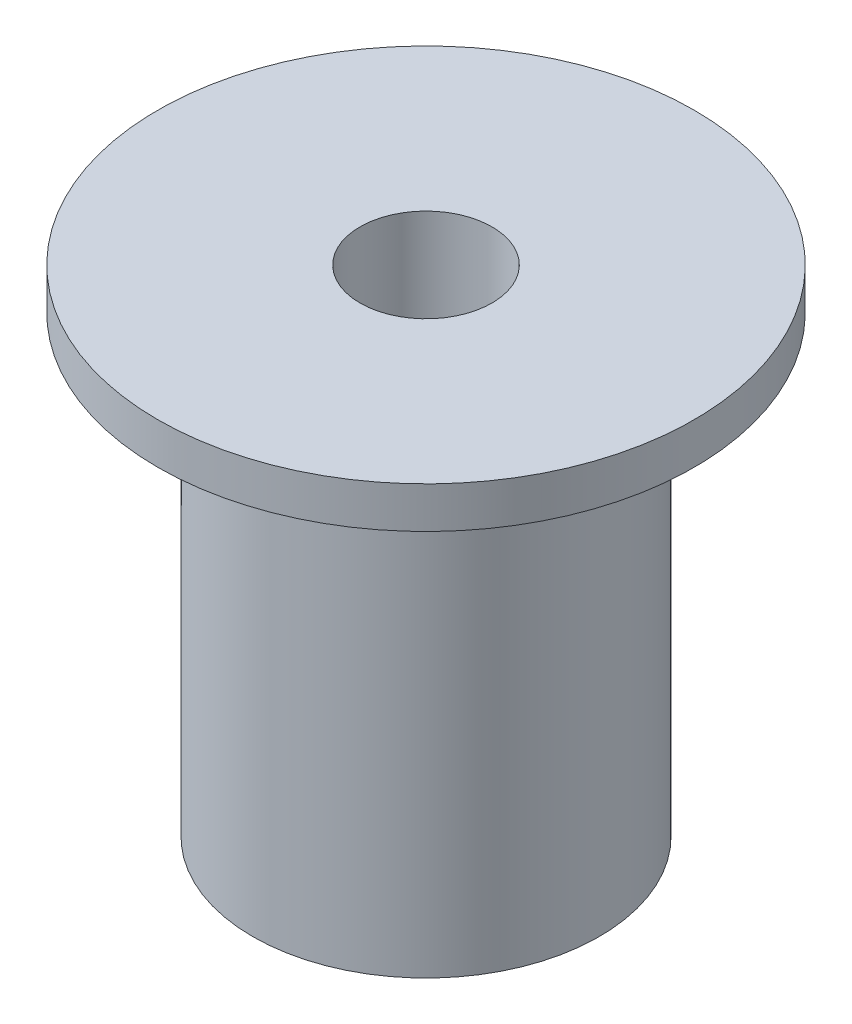
ISO-10303-21;
HEADER;
FILE_DESCRIPTION(('STEP AP214'),'2;1');
FILE_NAME('part.step','',(''),(''),'','','');
FILE_SCHEMA(('AUTOMOTIVE_DESIGN { 1 0 10303 214 1 1 1 1 }'));
ENDSEC;
DATA;
#1=APPLICATION_CONTEXT('core data for automotive mechanical design processes');
#2=APPLICATION_PROTOCOL_DEFINITION('international standard','automotive_design',2000,#1);
#3=PRODUCT_CONTEXT('',#1,'mechanical');
#4=PRODUCT('Part','Part','',(#3));
#5=PRODUCT_RELATED_PRODUCT_CATEGORY('part','',(#4));
#6=PRODUCT_DEFINITION_FORMATION('','',#4);
#7=PRODUCT_DEFINITION_CONTEXT('part definition',#1,'design');
#8=PRODUCT_DEFINITION('design','',#6,#7);
#9=PRODUCT_DEFINITION_SHAPE('','',#8);
#10=(LENGTH_UNIT() NAMED_UNIT(*) SI_UNIT(.MILLI.,.METRE.));
#11=(NAMED_UNIT(*) PLANE_ANGLE_UNIT() SI_UNIT($,.RADIAN.));
#12=(NAMED_UNIT(*) SI_UNIT($,.STERADIAN.) SOLID_ANGLE_UNIT());
#13=UNCERTAINTY_MEASURE_WITH_UNIT(LENGTH_MEASURE(1.E-05),#10,'distance_accuracy_value','');
#14=(GEOMETRIC_REPRESENTATION_CONTEXT(3) GLOBAL_UNCERTAINTY_ASSIGNED_CONTEXT((#13)) GLOBAL_UNIT_ASSIGNED_CONTEXT((#10,
#11,#12)) REPRESENTATION_CONTEXT('',''));
#15=CARTESIAN_POINT('',(0.,0.,0.));
#16=DIRECTION('',(0.,0.,1.));
#17=DIRECTION('',(1.,0.,0.));
#18=AXIS2_PLACEMENT_3D('',#15,#16,#17);
#19=CARTESIAN_POINT('',(0.,0.,0.));
#20=DIRECTION('',(0.,1.,0.));
#21=DIRECTION('',(0.,0.,1.));
#22=AXIS2_PLACEMENT_3D('',#19,#20,#21);
#23=PLANE('',#22);
#24=CARTESIAN_POINT('',(0.,0.,0.));
#25=DIRECTION('',(0.,1.,0.));
#26=DIRECTION('',(0.,0.,1.));
#27=AXIS2_PLACEMENT_3D('',#24,#25,#26);
#28=CIRCLE('',#27,4.2);
#29=CARTESIAN_POINT('',(0.,0.,4.2));
#30=VERTEX_POINT('',#29);
#31=EDGE_CURVE('E47',#30,#30,#28,.T.);
#32=ORIENTED_EDGE('',*,*,#31,.F.);
#33=EDGE_LOOP('',(#32));
#34=FACE_BOUND('',#33,.T.);
#35=CARTESIAN_POINT('',(0.,0.,0.));
#36=DIRECTION('',(0.,1.,0.));
#37=DIRECTION('',(0.,0.,1.));
#38=AXIS2_PLACEMENT_3D('',#35,#36,#37);
#39=CIRCLE('',#38,1.6);
#40=CARTESIAN_POINT('',(0.,0.,1.6));
#41=VERTEX_POINT('',#40);
#42=EDGE_CURVE('E56',#41,#41,#39,.T.);
#43=ORIENTED_EDGE('',*,*,#42,.T.);
#44=EDGE_LOOP('',(#43));
#45=FACE_BOUND('',#44,.T.);
#46=ADVANCED_FACE('F43',(#34,#45),#23,.F.);
#47=CARTESIAN_POINT('',(0.,11.,0.));
#48=DIRECTION('',(0.,-1.,0.));
#49=DIRECTION('',(0.,0.,-1.));
#50=AXIS2_PLACEMENT_3D('',#47,#48,#49);
#51=CYLINDRICAL_SURFACE('',#50,4.2);
#52=CARTESIAN_POINT('',(0.,11.,0.));
#53=DIRECTION('',(0.,1.,0.));
#54=DIRECTION('',(0.,0.,1.));
#55=AXIS2_PLACEMENT_3D('',#52,#53,#54);
#56=CIRCLE('',#55,4.2);
#57=CARTESIAN_POINT('',(0.,11.,4.2));
#58=VERTEX_POINT('',#57);
#59=EDGE_CURVE('E10',#58,#58,#56,.T.);
#60=ORIENTED_EDGE('',*,*,#59,.F.);
#61=EDGE_LOOP('',(#60));
#62=FACE_BOUND('',#61,.T.);
#63=ORIENTED_EDGE('',*,*,#31,.T.);
#64=EDGE_LOOP('',(#63));
#65=FACE_BOUND('',#64,.T.);
#66=ADVANCED_FACE('F45',(#62,#65),#51,.T.);
#67=CARTESIAN_POINT('',(0.,11.,0.));
#68=DIRECTION('',(0.,-1.,0.));
#69=DIRECTION('',(0.,0.,-1.));
#70=AXIS2_PLACEMENT_3D('',#67,#68,#69);
#71=CYLINDRICAL_SURFACE('',#70,1.6);
#72=ORIENTED_EDGE('',*,*,#42,.F.);
#73=EDGE_LOOP('',(#72));
#74=FACE_BOUND('',#73,.T.);
#75=CARTESIAN_POINT('',(0.,12.,0.));
#76=DIRECTION('',(0.,1.,0.));
#77=DIRECTION('',(0.,0.,1.));
#78=AXIS2_PLACEMENT_3D('',#75,#76,#77);
#79=CIRCLE('',#78,1.6);
#80=CARTESIAN_POINT('',(0.,12.,1.6));
#81=VERTEX_POINT('',#80);
#82=EDGE_CURVE('E66',#81,#81,#79,.T.);
#83=ORIENTED_EDGE('',*,*,#82,.T.);
#84=EDGE_LOOP('',(#83));
#85=FACE_BOUND('',#84,.T.);
#86=ADVANCED_FACE('F74',(#74,#85),#71,.F.);
#87=CARTESIAN_POINT('',(0.,12.,0.));
#88=DIRECTION('',(0.,1.,0.));
#89=DIRECTION('',(0.,0.,1.));
#90=AXIS2_PLACEMENT_3D('',#87,#88,#89);
#91=PLANE('',#90);
#92=CARTESIAN_POINT('',(0.,12.,0.));
#93=DIRECTION('',(0.,1.,0.));
#94=DIRECTION('',(0.,0.,1.));
#95=AXIS2_PLACEMENT_3D('',#92,#93,#94);
#96=CIRCLE('',#95,6.5);
#97=CARTESIAN_POINT('',(0.,12.,6.5));
#98=VERTEX_POINT('',#97);
#99=EDGE_CURVE('E61',#98,#98,#96,.T.);
#100=ORIENTED_EDGE('',*,*,#99,.T.);
#101=EDGE_LOOP('',(#100));
#102=FACE_BOUND('',#101,.T.);
#103=ORIENTED_EDGE('',*,*,#82,.F.);
#104=EDGE_LOOP('',(#103));
#105=FACE_BOUND('',#104,.T.);
#106=ADVANCED_FACE('F76',(#102,#105),#91,.T.);
#107=CARTESIAN_POINT('',(0.,11.,0.));
#108=DIRECTION('',(0.,1.,0.));
#109=DIRECTION('',(0.,0.,1.));
#110=AXIS2_PLACEMENT_3D('',#107,#108,#109);
#111=PLANE('',#110);
#112=ORIENTED_EDGE('',*,*,#59,.T.);
#113=EDGE_LOOP('',(#112));
#114=FACE_BOUND('',#113,.T.);
#115=CARTESIAN_POINT('',(0.,11.,0.));
#116=DIRECTION('',(0.,1.,0.));
#117=DIRECTION('',(0.,0.,1.));
#118=AXIS2_PLACEMENT_3D('',#115,#116,#117);
#119=CIRCLE('',#118,6.5);
#120=CARTESIAN_POINT('',(0.,11.,6.5));
#121=VERTEX_POINT('',#120);
#122=EDGE_CURVE('E62',#121,#121,#119,.T.);
#123=ORIENTED_EDGE('',*,*,#122,.F.);
#124=EDGE_LOOP('',(#123));
#125=FACE_BOUND('',#124,.T.);
#126=ADVANCED_FACE('F78',(#114,#125),#111,.F.);
#127=CARTESIAN_POINT('',(0.,12.,0.));
#128=DIRECTION('',(0.,-1.,0.));
#129=DIRECTION('',(0.,0.,-1.));
#130=AXIS2_PLACEMENT_3D('',#127,#128,#129);
#131=CYLINDRICAL_SURFACE('',#130,6.5);
#132=ORIENTED_EDGE('',*,*,#99,.F.);
#133=EDGE_LOOP('',(#132));
#134=FACE_BOUND('',#133,.T.);
#135=ORIENTED_EDGE('',*,*,#122,.T.);
#136=EDGE_LOOP('',(#135));
#137=FACE_BOUND('',#136,.T.);
#138=ADVANCED_FACE('F85',(#134,#137),#131,.T.);
#139=CLOSED_SHELL('',(#46,#66,#86,#106,#126,#138));
#140=MANIFOLD_SOLID_BREP('B2',#139);
#141=ADVANCED_BREP_SHAPE_REPRESENTATION('',(#18,#140),#14);
#142=SHAPE_DEFINITION_REPRESENTATION(#9,#141);
ENDSEC;
END-ISO-10303-21;
